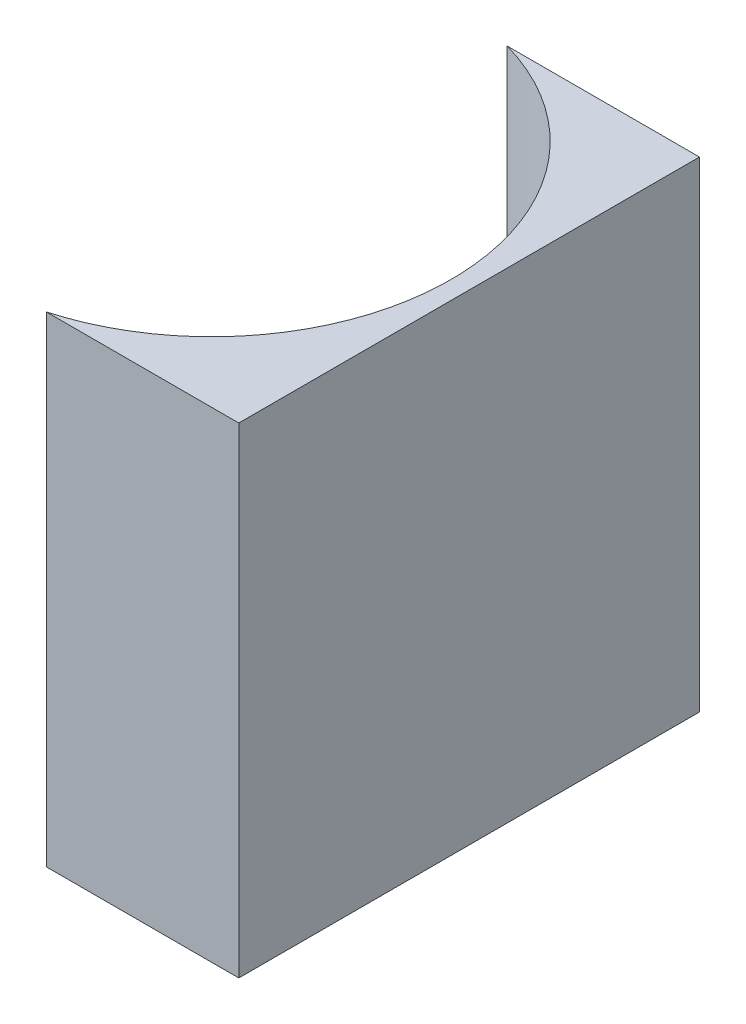
ISO-10303-21;
HEADER;
FILE_DESCRIPTION(('STEP AP214'),'2;1');
FILE_NAME('part.step','',(''),(''),'','','');
FILE_SCHEMA(('AUTOMOTIVE_DESIGN { 1 0 10303 214 1 1 1 1 }'));
ENDSEC;
DATA;
#1=APPLICATION_CONTEXT('core data for automotive mechanical design processes');
#2=APPLICATION_PROTOCOL_DEFINITION('international standard','automotive_design',2000,#1);
#3=PRODUCT_CONTEXT('',#1,'mechanical');
#4=PRODUCT('Part','Part','',(#3));
#5=PRODUCT_RELATED_PRODUCT_CATEGORY('part','',(#4));
#6=PRODUCT_DEFINITION_FORMATION('','',#4);
#7=PRODUCT_DEFINITION_CONTEXT('part definition',#1,'design');
#8=PRODUCT_DEFINITION('design','',#6,#7);
#9=PRODUCT_DEFINITION_SHAPE('','',#8);
#10=(LENGTH_UNIT() NAMED_UNIT(*) SI_UNIT(.MILLI.,.METRE.));
#11=(NAMED_UNIT(*) PLANE_ANGLE_UNIT() SI_UNIT($,.RADIAN.));
#12=(NAMED_UNIT(*) SI_UNIT($,.STERADIAN.) SOLID_ANGLE_UNIT());
#13=UNCERTAINTY_MEASURE_WITH_UNIT(LENGTH_MEASURE(1.E-05),#10,'distance_accuracy_value','');
#14=(GEOMETRIC_REPRESENTATION_CONTEXT(3) GLOBAL_UNCERTAINTY_ASSIGNED_CONTEXT((#13)) GLOBAL_UNIT_ASSIGNED_CONTEXT((#10,
#11,#12)) REPRESENTATION_CONTEXT('',''));
#15=CARTESIAN_POINT('',(0.,0.,0.));
#16=DIRECTION('',(0.,0.,1.));
#17=DIRECTION('',(1.,0.,0.));
#18=AXIS2_PLACEMENT_3D('',#15,#16,#17);
#19=CARTESIAN_POINT('',(0.,53.,0.));
#20=DIRECTION('',(0.,0.,1.));
#21=DIRECTION('',(1.,0.,0.));
#22=AXIS2_PLACEMENT_3D('',#19,#20,#21);
#23=PLANE('',#22);
#24=DIRECTION('',(-1.,0.,0.));
#25=VECTOR('',#24,1.);
#26=CARTESIAN_POINT('',(0.,0.,0.));
#27=LINE('',#26,#25);
#28=CARTESIAN_POINT('',(0.,0.,0.));
#29=VERTEX_POINT('',#28);
#30=CARTESIAN_POINT('',(-21.2027783138214,0.,0.));
#31=VERTEX_POINT('',#30);
#32=EDGE_CURVE('E100',#29,#31,#27,.T.);
#33=ORIENTED_EDGE('',*,*,#32,.T.);
#34=DIRECTION('',(0.,-1.,0.));
#35=VECTOR('',#34,1.);
#36=CARTESIAN_POINT('',(-21.2027783138214,53.,0.));
#37=LINE('',#36,#35);
#38=CARTESIAN_POINT('',(-21.2027783138214,53.,0.));
#39=VERTEX_POINT('',#38);
#40=EDGE_CURVE('E11',#39,#31,#37,.T.);
#41=ORIENTED_EDGE('',*,*,#40,.F.);
#42=DIRECTION('',(-1.,0.,0.));
#43=VECTOR('',#42,1.);
#44=CARTESIAN_POINT('',(0.,53.,0.));
#45=LINE('',#44,#43);
#46=CARTESIAN_POINT('',(0.,53.,0.));
#47=VERTEX_POINT('',#46);
#48=EDGE_CURVE('E88',#47,#39,#45,.T.);
#49=ORIENTED_EDGE('',*,*,#48,.F.);
#50=DIRECTION('',(0.,-1.,0.));
#51=VECTOR('',#50,1.);
#52=CARTESIAN_POINT('',(0.,53.,0.));
#53=LINE('',#52,#51);
#54=EDGE_CURVE('E96',#47,#29,#53,.T.);
#55=ORIENTED_EDGE('',*,*,#54,.T.);
#56=EDGE_LOOP('',(#33,#41,#49,#55));
#57=FACE_BOUND('',#56,.T.);
#58=ADVANCED_FACE('F37',(#57),#23,.F.);
#59=CARTESIAN_POINT('',(-28.4,53.,25.4));
#60=DIRECTION('',(0.,-1.,0.));
#61=DIRECTION('',(0.,0.,-1.));
#62=AXIS2_PLACEMENT_3D('',#59,#60,#61);
#63=CYLINDRICAL_SURFACE('',#62,26.4);
#64=CARTESIAN_POINT('',(-28.4,0.,25.4));
#65=DIRECTION('',(0.,-1.,0.));
#66=DIRECTION('',(0.,0.,1.));
#67=AXIS2_PLACEMENT_3D('',#64,#65,#66);
#68=CIRCLE('',#67,26.4);
#69=CARTESIAN_POINT('',(-21.2027783138214,0.,50.8));
#70=VERTEX_POINT('',#69);
#71=EDGE_CURVE('E92',#31,#70,#68,.T.);
#72=ORIENTED_EDGE('',*,*,#71,.T.);
#73=DIRECTION('',(0.,-1.,0.));
#74=VECTOR('',#73,1.);
#75=CARTESIAN_POINT('',(-21.2027783138214,53.,50.8));
#76=LINE('',#75,#74);
#77=CARTESIAN_POINT('',(-21.2027783138214,53.,50.8));
#78=VERTEX_POINT('',#77);
#79=EDGE_CURVE('E45',#78,#70,#76,.T.);
#80=ORIENTED_EDGE('',*,*,#79,.F.);
#81=CARTESIAN_POINT('',(-28.4,53.,25.4));
#82=DIRECTION('',(0.,-1.,0.));
#83=DIRECTION('',(0.,0.,1.));
#84=AXIS2_PLACEMENT_3D('',#81,#82,#83);
#85=CIRCLE('',#84,26.4);
#86=EDGE_CURVE('E83',#39,#78,#85,.T.);
#87=ORIENTED_EDGE('',*,*,#86,.F.);
#88=ORIENTED_EDGE('',*,*,#40,.T.);
#89=EDGE_LOOP('',(#72,#80,#87,#88));
#90=FACE_BOUND('',#89,.T.);
#91=ADVANCED_FACE('F91',(#90),#63,.F.);
#92=CARTESIAN_POINT('',(0.,53.,50.8));
#93=DIRECTION('',(0.,0.,-1.));
#94=DIRECTION('',(-1.,0.,0.));
#95=AXIS2_PLACEMENT_3D('',#92,#93,#94);
#96=PLANE('',#95);
#97=DIRECTION('',(1.,0.,0.));
#98=VECTOR('',#97,1.);
#99=CARTESIAN_POINT('',(0.,0.,50.8));
#100=LINE('',#99,#98);
#101=CARTESIAN_POINT('',(0.,0.,50.8));
#102=VERTEX_POINT('',#101);
#103=EDGE_CURVE('E70',#70,#102,#100,.T.);
#104=ORIENTED_EDGE('',*,*,#103,.T.);
#105=DIRECTION('',(0.,-1.,0.));
#106=VECTOR('',#105,1.);
#107=CARTESIAN_POINT('',(0.,53.,50.8));
#108=LINE('',#107,#106);
#109=CARTESIAN_POINT('',(0.,53.,50.8));
#110=VERTEX_POINT('',#109);
#111=EDGE_CURVE('E93',#110,#102,#108,.T.);
#112=ORIENTED_EDGE('',*,*,#111,.F.);
#113=DIRECTION('',(1.,0.,0.));
#114=VECTOR('',#113,1.);
#115=CARTESIAN_POINT('',(0.,53.,50.8));
#116=LINE('',#115,#114);
#117=EDGE_CURVE('E86',#78,#110,#116,.T.);
#118=ORIENTED_EDGE('',*,*,#117,.F.);
#119=ORIENTED_EDGE('',*,*,#79,.T.);
#120=EDGE_LOOP('',(#104,#112,#118,#119));
#121=FACE_BOUND('',#120,.T.);
#122=ADVANCED_FACE('F94',(#121),#96,.F.);
#123=CARTESIAN_POINT('',(0.,53.,0.));
#124=DIRECTION('',(-1.,0.,0.));
#125=DIRECTION('',(0.,0.,1.));
#126=AXIS2_PLACEMENT_3D('',#123,#124,#125);
#127=PLANE('',#126);
#128=DIRECTION('',(0.,0.,-1.));
#129=VECTOR('',#128,1.);
#130=CARTESIAN_POINT('',(0.,0.,0.));
#131=LINE('',#130,#129);
#132=EDGE_CURVE('E76',#102,#29,#131,.T.);
#133=ORIENTED_EDGE('',*,*,#132,.T.);
#134=ORIENTED_EDGE('',*,*,#54,.F.);
#135=DIRECTION('',(0.,0.,-1.));
#136=VECTOR('',#135,1.);
#137=CARTESIAN_POINT('',(0.,53.,0.));
#138=LINE('',#137,#136);
#139=EDGE_CURVE('E53',#110,#47,#138,.T.);
#140=ORIENTED_EDGE('',*,*,#139,.F.);
#141=ORIENTED_EDGE('',*,*,#111,.T.);
#142=EDGE_LOOP('',(#133,#134,#140,#141));
#143=FACE_BOUND('',#142,.T.);
#144=ADVANCED_FACE('F107',(#143),#127,.F.);
#145=CARTESIAN_POINT('',(-28.4,53.,25.4));
#146=DIRECTION('',(0.,1.,0.));
#147=DIRECTION('',(0.,0.,1.));
#148=AXIS2_PLACEMENT_3D('',#145,#146,#147);
#149=PLANE('',#148);
#150=ORIENTED_EDGE('',*,*,#48,.T.);
#151=ORIENTED_EDGE('',*,*,#86,.T.);
#152=ORIENTED_EDGE('',*,*,#117,.T.);
#153=ORIENTED_EDGE('',*,*,#139,.T.);
#154=EDGE_LOOP('',(#150,#151,#152,#153));
#155=FACE_BOUND('',#154,.T.);
#156=ADVANCED_FACE('F84',(#155),#149,.T.);
#157=CARTESIAN_POINT('',(-28.4,0.,25.4));
#158=DIRECTION('',(0.,1.,0.));
#159=DIRECTION('',(0.,0.,1.));
#160=AXIS2_PLACEMENT_3D('',#157,#158,#159);
#161=PLANE('',#160);
#162=ORIENTED_EDGE('',*,*,#32,.F.);
#163=ORIENTED_EDGE('',*,*,#132,.F.);
#164=ORIENTED_EDGE('',*,*,#103,.F.);
#165=ORIENTED_EDGE('',*,*,#71,.F.);
#166=EDGE_LOOP('',(#162,#163,#164,#165));
#167=FACE_BOUND('',#166,.T.);
#168=ADVANCED_FACE('F110',(#167),#161,.F.);
#169=CLOSED_SHELL('',(#58,#91,#122,#144,#156,#168));
#170=MANIFOLD_SOLID_BREP('B2',#169);
#171=ADVANCED_BREP_SHAPE_REPRESENTATION('',(#18,#170),#14);
#172=SHAPE_DEFINITION_REPRESENTATION(#9,#171);
ENDSEC;
END-ISO-10303-21;
